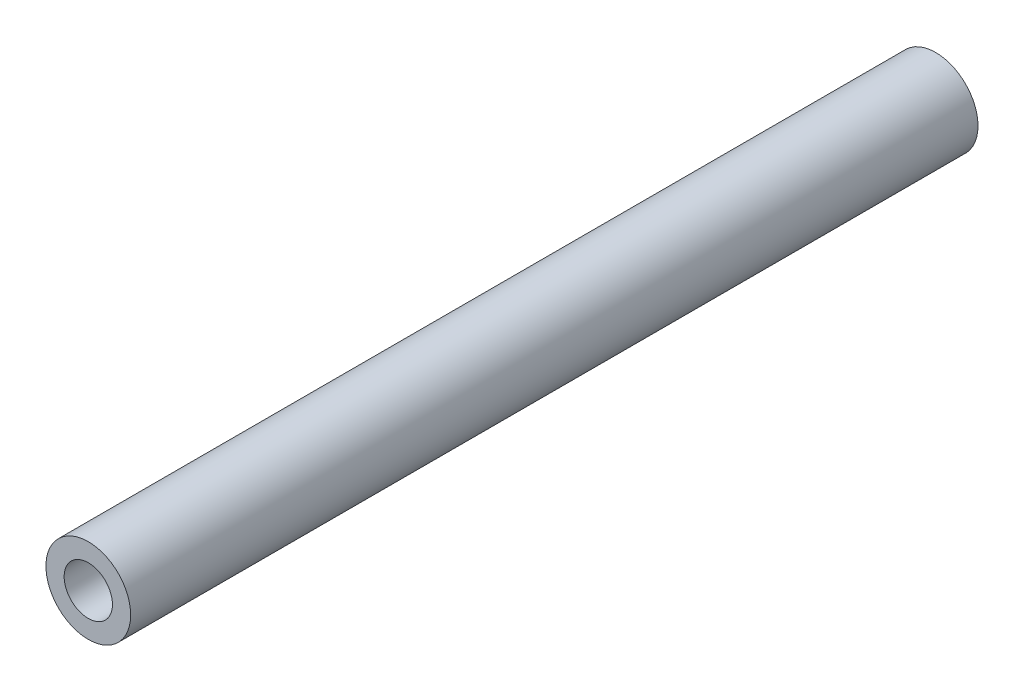
ISO-10303-21;
HEADER;
FILE_DESCRIPTION(('STEP AP214'),'2;1');
FILE_NAME('part.step','',(''),(''),'','','');
FILE_SCHEMA(('AUTOMOTIVE_DESIGN { 1 0 10303 214 1 1 1 1 }'));
ENDSEC;
DATA;
#1=APPLICATION_CONTEXT('core data for automotive mechanical design processes');
#2=APPLICATION_PROTOCOL_DEFINITION('international standard','automotive_design',2000,#1);
#3=PRODUCT_CONTEXT('',#1,'mechanical');
#4=PRODUCT('Part','Part','',(#3));
#5=PRODUCT_RELATED_PRODUCT_CATEGORY('part','',(#4));
#6=PRODUCT_DEFINITION_FORMATION('','',#4);
#7=PRODUCT_DEFINITION_CONTEXT('part definition',#1,'design');
#8=PRODUCT_DEFINITION('design','',#6,#7);
#9=PRODUCT_DEFINITION_SHAPE('','',#8);
#10=(LENGTH_UNIT() NAMED_UNIT(*) SI_UNIT(.MILLI.,.METRE.));
#11=(NAMED_UNIT(*) PLANE_ANGLE_UNIT() SI_UNIT($,.RADIAN.));
#12=(NAMED_UNIT(*) SI_UNIT($,.STERADIAN.) SOLID_ANGLE_UNIT());
#13=UNCERTAINTY_MEASURE_WITH_UNIT(LENGTH_MEASURE(1.E-05),#10,'distance_accuracy_value','');
#14=(GEOMETRIC_REPRESENTATION_CONTEXT(3) GLOBAL_UNCERTAINTY_ASSIGNED_CONTEXT((#13)) GLOBAL_UNIT_ASSIGNED_CONTEXT((#10,
#11,#12)) REPRESENTATION_CONTEXT('',''));
#15=CARTESIAN_POINT('',(0.,0.,0.));
#16=DIRECTION('',(0.,0.,1.));
#17=DIRECTION('',(1.,0.,0.));
#18=AXIS2_PLACEMENT_3D('',#15,#16,#17);
#19=CARTESIAN_POINT('',(0.,0.,100.));
#20=DIRECTION('',(0.,0.,1.));
#21=DIRECTION('',(1.,0.,0.));
#22=AXIS2_PLACEMENT_3D('',#19,#20,#21);
#23=PLANE('',#22);
#24=CARTESIAN_POINT('',(0.,0.,100.));
#25=DIRECTION('',(0.,0.,1.));
#26=DIRECTION('',(1.,0.,0.));
#27=AXIS2_PLACEMENT_3D('',#24,#25,#26);
#28=CIRCLE('',#27,5.);
#29=CARTESIAN_POINT('',(5.,0.,100.));
#30=VERTEX_POINT('',#29);
#31=EDGE_CURVE('E10',#30,#30,#28,.T.);
#32=ORIENTED_EDGE('',*,*,#31,.T.);
#33=EDGE_LOOP('',(#32));
#34=FACE_BOUND('',#33,.T.);
#35=CARTESIAN_POINT('',(0.,0.,100.));
#36=DIRECTION('',(0.,0.,1.));
#37=DIRECTION('',(1.,0.,0.));
#38=AXIS2_PLACEMENT_3D('',#35,#36,#37);
#39=CIRCLE('',#38,2.85);
#40=CARTESIAN_POINT('',(2.85,0.,100.));
#41=VERTEX_POINT('',#40);
#42=EDGE_CURVE('E48',#41,#41,#39,.T.);
#43=ORIENTED_EDGE('',*,*,#42,.F.);
#44=EDGE_LOOP('',(#43));
#45=FACE_BOUND('',#44,.T.);
#46=ADVANCED_FACE('F34',(#34,#45),#23,.T.);
#47=CARTESIAN_POINT('',(0.,0.,0.));
#48=DIRECTION('',(0.,0.,1.));
#49=DIRECTION('',(1.,0.,0.));
#50=AXIS2_PLACEMENT_3D('',#47,#48,#49);
#51=PLANE('',#50);
#52=CARTESIAN_POINT('',(0.,0.,0.));
#53=DIRECTION('',(0.,0.,1.));
#54=DIRECTION('',(1.,0.,0.));
#55=AXIS2_PLACEMENT_3D('',#52,#53,#54);
#56=CIRCLE('',#55,5.);
#57=CARTESIAN_POINT('',(5.,0.,0.));
#58=VERTEX_POINT('',#57);
#59=EDGE_CURVE('E38',#58,#58,#56,.T.);
#60=ORIENTED_EDGE('',*,*,#59,.F.);
#61=EDGE_LOOP('',(#60));
#62=FACE_BOUND('',#61,.T.);
#63=CARTESIAN_POINT('',(0.,0.,0.));
#64=DIRECTION('',(0.,0.,1.));
#65=DIRECTION('',(1.,0.,0.));
#66=AXIS2_PLACEMENT_3D('',#63,#64,#65);
#67=CIRCLE('',#66,2.85);
#68=CARTESIAN_POINT('',(2.85,0.,0.));
#69=VERTEX_POINT('',#68);
#70=EDGE_CURVE('E50',#69,#69,#67,.T.);
#71=ORIENTED_EDGE('',*,*,#70,.T.);
#72=EDGE_LOOP('',(#71));
#73=FACE_BOUND('',#72,.T.);
#74=ADVANCED_FACE('F63',(#62,#73),#51,.F.);
#75=CARTESIAN_POINT('',(0.,0.,100.));
#76=DIRECTION('',(0.,0.,-1.));
#77=DIRECTION('',(-1.,0.,0.));
#78=AXIS2_PLACEMENT_3D('',#75,#76,#77);
#79=CYLINDRICAL_SURFACE('',#78,5.);
#80=ORIENTED_EDGE('',*,*,#31,.F.);
#81=EDGE_LOOP('',(#80));
#82=FACE_BOUND('',#81,.T.);
#83=ORIENTED_EDGE('',*,*,#59,.T.);
#84=EDGE_LOOP('',(#83));
#85=FACE_BOUND('',#84,.T.);
#86=ADVANCED_FACE('F36',(#82,#85),#79,.T.);
#87=CARTESIAN_POINT('',(0.,0.,100.));
#88=DIRECTION('',(0.,0.,-1.));
#89=DIRECTION('',(-1.,0.,0.));
#90=AXIS2_PLACEMENT_3D('',#87,#88,#89);
#91=CYLINDRICAL_SURFACE('',#90,2.85);
#92=ORIENTED_EDGE('',*,*,#42,.T.);
#93=EDGE_LOOP('',(#92));
#94=FACE_BOUND('',#93,.T.);
#95=ORIENTED_EDGE('',*,*,#70,.F.);
#96=EDGE_LOOP('',(#95));
#97=FACE_BOUND('',#96,.T.);
#98=ADVANCED_FACE('F59',(#94,#97),#91,.F.);
#99=CLOSED_SHELL('',(#46,#74,#86,#98));
#100=MANIFOLD_SOLID_BREP('B2',#99);
#101=ADVANCED_BREP_SHAPE_REPRESENTATION('',(#18,#100),#14);
#102=SHAPE_DEFINITION_REPRESENTATION(#9,#101);
ENDSEC;
END-ISO-10303-21;
